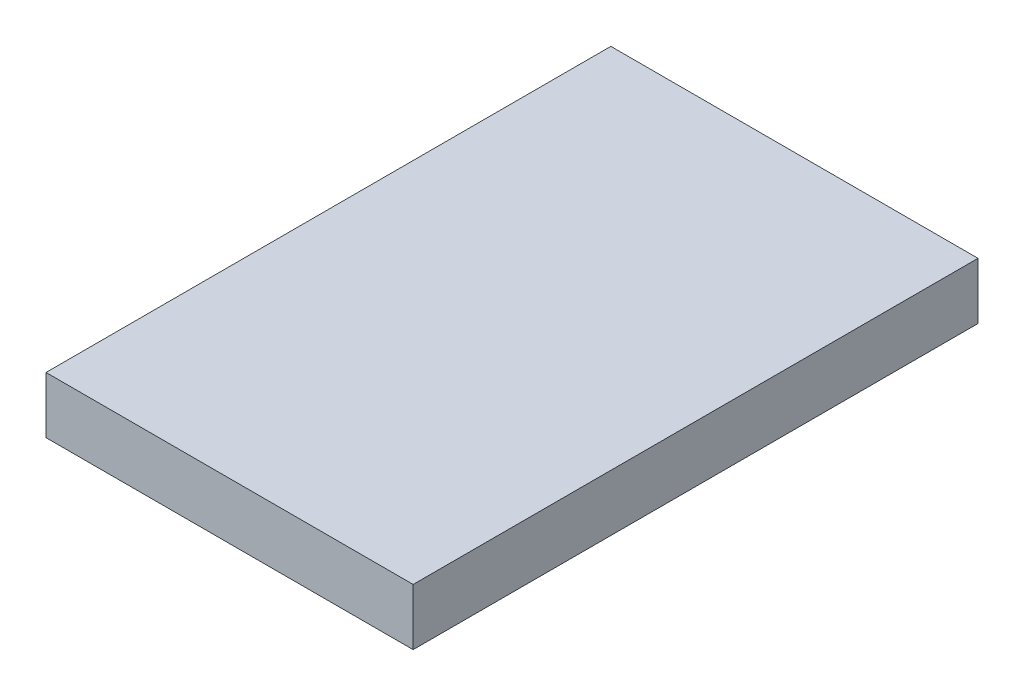
ISO-10303-21;
HEADER;
FILE_DESCRIPTION(('STEP AP214'),'2;1');
FILE_NAME('part.step','',(''),(''),'','','');
FILE_SCHEMA(('AUTOMOTIVE_DESIGN { 1 0 10303 214 1 1 1 1 }'));
ENDSEC;
DATA;
#1=APPLICATION_CONTEXT('core data for automotive mechanical design processes');
#2=APPLICATION_PROTOCOL_DEFINITION('international standard','automotive_design',2000,#1);
#3=PRODUCT_CONTEXT('',#1,'mechanical');
#4=PRODUCT('Part','Part','',(#3));
#5=PRODUCT_RELATED_PRODUCT_CATEGORY('part','',(#4));
#6=PRODUCT_DEFINITION_FORMATION('','',#4);
#7=PRODUCT_DEFINITION_CONTEXT('part definition',#1,'design');
#8=PRODUCT_DEFINITION('design','',#6,#7);
#9=PRODUCT_DEFINITION_SHAPE('','',#8);
#10=(LENGTH_UNIT() NAMED_UNIT(*) SI_UNIT(.MILLI.,.METRE.));
#11=(NAMED_UNIT(*) PLANE_ANGLE_UNIT() SI_UNIT($,.RADIAN.));
#12=(NAMED_UNIT(*) SI_UNIT($,.STERADIAN.) SOLID_ANGLE_UNIT());
#13=UNCERTAINTY_MEASURE_WITH_UNIT(LENGTH_MEASURE(1.E-05),#10,'distance_accuracy_value','');
#14=(GEOMETRIC_REPRESENTATION_CONTEXT(3) GLOBAL_UNCERTAINTY_ASSIGNED_CONTEXT((#13)) GLOBAL_UNIT_ASSIGNED_CONTEXT((#10,
#11,#12)) REPRESENTATION_CONTEXT('',''));
#15=CARTESIAN_POINT('',(0.,0.,0.));
#16=DIRECTION('',(0.,0.,1.));
#17=DIRECTION('',(1.,0.,0.));
#18=AXIS2_PLACEMENT_3D('',#15,#16,#17);
#19=CARTESIAN_POINT('',(13.,4.,20.));
#20=DIRECTION('',(-1.,0.,0.));
#21=DIRECTION('',(0.,0.,1.));
#22=AXIS2_PLACEMENT_3D('',#19,#20,#21);
#23=PLANE('',#22);
#24=DIRECTION('',(0.,0.,-1.));
#25=VECTOR('',#24,1.);
#26=CARTESIAN_POINT('',(13.,0.,20.));
#27=LINE('',#26,#25);
#28=CARTESIAN_POINT('',(13.,0.,20.));
#29=VERTEX_POINT('',#28);
#30=CARTESIAN_POINT('',(13.,0.,-20.));
#31=VERTEX_POINT('',#30);
#32=EDGE_CURVE('E97',#29,#31,#27,.T.);
#33=ORIENTED_EDGE('',*,*,#32,.T.);
#34=DIRECTION('',(0.,-1.,0.));
#35=VECTOR('',#34,1.);
#36=CARTESIAN_POINT('',(13.,4.,-20.));
#37=LINE('',#36,#35);
#38=CARTESIAN_POINT('',(13.,4.,-20.));
#39=VERTEX_POINT('',#38);
#40=EDGE_CURVE('E11',#39,#31,#37,.T.);
#41=ORIENTED_EDGE('',*,*,#40,.F.);
#42=DIRECTION('',(0.,0.,-1.));
#43=VECTOR('',#42,1.);
#44=CARTESIAN_POINT('',(13.,4.,20.));
#45=LINE('',#44,#43);
#46=CARTESIAN_POINT('',(13.,4.,20.));
#47=VERTEX_POINT('',#46);
#48=EDGE_CURVE('E85',#47,#39,#45,.T.);
#49=ORIENTED_EDGE('',*,*,#48,.F.);
#50=DIRECTION('',(0.,-1.,0.));
#51=VECTOR('',#50,1.);
#52=CARTESIAN_POINT('',(13.,4.,20.));
#53=LINE('',#52,#51);
#54=EDGE_CURVE('E93',#47,#29,#53,.T.);
#55=ORIENTED_EDGE('',*,*,#54,.T.);
#56=EDGE_LOOP('',(#33,#41,#49,#55));
#57=FACE_BOUND('',#56,.T.);
#58=ADVANCED_FACE('F34',(#57),#23,.F.);
#59=CARTESIAN_POINT('',(-13.,4.,-20.));
#60=DIRECTION('',(0.,0.,1.));
#61=DIRECTION('',(1.,0.,0.));
#62=AXIS2_PLACEMENT_3D('',#59,#60,#61);
#63=PLANE('',#62);
#64=DIRECTION('',(-1.,0.,0.));
#65=VECTOR('',#64,1.);
#66=CARTESIAN_POINT('',(-13.,0.,-20.));
#67=LINE('',#66,#65);
#68=CARTESIAN_POINT('',(-13.,0.,-20.));
#69=VERTEX_POINT('',#68);
#70=EDGE_CURVE('E89',#31,#69,#67,.T.);
#71=ORIENTED_EDGE('',*,*,#70,.T.);
#72=DIRECTION('',(0.,-1.,0.));
#73=VECTOR('',#72,1.);
#74=CARTESIAN_POINT('',(-13.,4.,-20.));
#75=LINE('',#74,#73);
#76=CARTESIAN_POINT('',(-13.,4.,-20.));
#77=VERTEX_POINT('',#76);
#78=EDGE_CURVE('E42',#77,#69,#75,.T.);
#79=ORIENTED_EDGE('',*,*,#78,.F.);
#80=DIRECTION('',(-1.,0.,0.));
#81=VECTOR('',#80,1.);
#82=CARTESIAN_POINT('',(-13.,4.,-20.));
#83=LINE('',#82,#81);
#84=EDGE_CURVE('E80',#39,#77,#83,.T.);
#85=ORIENTED_EDGE('',*,*,#84,.F.);
#86=ORIENTED_EDGE('',*,*,#40,.T.);
#87=EDGE_LOOP('',(#71,#79,#85,#86));
#88=FACE_BOUND('',#87,.T.);
#89=ADVANCED_FACE('F88',(#88),#63,.F.);
#90=CARTESIAN_POINT('',(-13.,4.,20.));
#91=DIRECTION('',(1.,0.,0.));
#92=DIRECTION('',(0.,0.,-1.));
#93=AXIS2_PLACEMENT_3D('',#90,#91,#92);
#94=PLANE('',#93);
#95=DIRECTION('',(0.,0.,1.));
#96=VECTOR('',#95,1.);
#97=CARTESIAN_POINT('',(-13.,0.,20.));
#98=LINE('',#97,#96);
#99=CARTESIAN_POINT('',(-13.,0.,20.));
#100=VERTEX_POINT('',#99);
#101=EDGE_CURVE('E67',#69,#100,#98,.T.);
#102=ORIENTED_EDGE('',*,*,#101,.T.);
#103=DIRECTION('',(0.,-1.,0.));
#104=VECTOR('',#103,1.);
#105=CARTESIAN_POINT('',(-13.,4.,20.));
#106=LINE('',#105,#104);
#107=CARTESIAN_POINT('',(-13.,4.,20.));
#108=VERTEX_POINT('',#107);
#109=EDGE_CURVE('E90',#108,#100,#106,.T.);
#110=ORIENTED_EDGE('',*,*,#109,.F.);
#111=DIRECTION('',(0.,0.,1.));
#112=VECTOR('',#111,1.);
#113=CARTESIAN_POINT('',(-13.,4.,20.));
#114=LINE('',#113,#112);
#115=EDGE_CURVE('E83',#77,#108,#114,.T.);
#116=ORIENTED_EDGE('',*,*,#115,.F.);
#117=ORIENTED_EDGE('',*,*,#78,.T.);
#118=EDGE_LOOP('',(#102,#110,#116,#117));
#119=FACE_BOUND('',#118,.T.);
#120=ADVANCED_FACE('F91',(#119),#94,.F.);
#121=CARTESIAN_POINT('',(-13.,4.,20.));
#122=DIRECTION('',(0.,0.,-1.));
#123=DIRECTION('',(-1.,0.,0.));
#124=AXIS2_PLACEMENT_3D('',#121,#122,#123);
#125=PLANE('',#124);
#126=DIRECTION('',(1.,0.,0.));
#127=VECTOR('',#126,1.);
#128=CARTESIAN_POINT('',(-13.,0.,20.));
#129=LINE('',#128,#127);
#130=EDGE_CURVE('E73',#100,#29,#129,.T.);
#131=ORIENTED_EDGE('',*,*,#130,.T.);
#132=ORIENTED_EDGE('',*,*,#54,.F.);
#133=DIRECTION('',(1.,0.,0.));
#134=VECTOR('',#133,1.);
#135=CARTESIAN_POINT('',(-13.,4.,20.));
#136=LINE('',#135,#134);
#137=EDGE_CURVE('E50',#108,#47,#136,.T.);
#138=ORIENTED_EDGE('',*,*,#137,.F.);
#139=ORIENTED_EDGE('',*,*,#109,.T.);
#140=EDGE_LOOP('',(#131,#132,#138,#139));
#141=FACE_BOUND('',#140,.T.);
#142=ADVANCED_FACE('F104',(#141),#125,.F.);
#143=CARTESIAN_POINT('',(13.,4.,-20.));
#144=DIRECTION('',(0.,-1.,0.));
#145=DIRECTION('',(0.,0.,-1.));
#146=AXIS2_PLACEMENT_3D('',#143,#144,#145);
#147=PLANE('',#146);
#148=ORIENTED_EDGE('',*,*,#48,.T.);
#149=ORIENTED_EDGE('',*,*,#84,.T.);
#150=ORIENTED_EDGE('',*,*,#115,.T.);
#151=ORIENTED_EDGE('',*,*,#137,.T.);
#152=EDGE_LOOP('',(#148,#149,#150,#151));
#153=FACE_BOUND('',#152,.T.);
#154=ADVANCED_FACE('F81',(#153),#147,.F.);
#155=CARTESIAN_POINT('',(13.,0.,-20.));
#156=DIRECTION('',(0.,-1.,0.));
#157=DIRECTION('',(0.,0.,-1.));
#158=AXIS2_PLACEMENT_3D('',#155,#156,#157);
#159=PLANE('',#158);
#160=ORIENTED_EDGE('',*,*,#32,.F.);
#161=ORIENTED_EDGE('',*,*,#130,.F.);
#162=ORIENTED_EDGE('',*,*,#101,.F.);
#163=ORIENTED_EDGE('',*,*,#70,.F.);
#164=EDGE_LOOP('',(#160,#161,#162,#163));
#165=FACE_BOUND('',#164,.T.);
#166=ADVANCED_FACE('F107',(#165),#159,.T.);
#167=CLOSED_SHELL('',(#58,#89,#120,#142,#154,#166));
#168=MANIFOLD_SOLID_BREP('B2',#167);
#169=ADVANCED_BREP_SHAPE_REPRESENTATION('',(#18,#168),#14);
#170=SHAPE_DEFINITION_REPRESENTATION(#9,#169);
ENDSEC;
END-ISO-10303-21;
